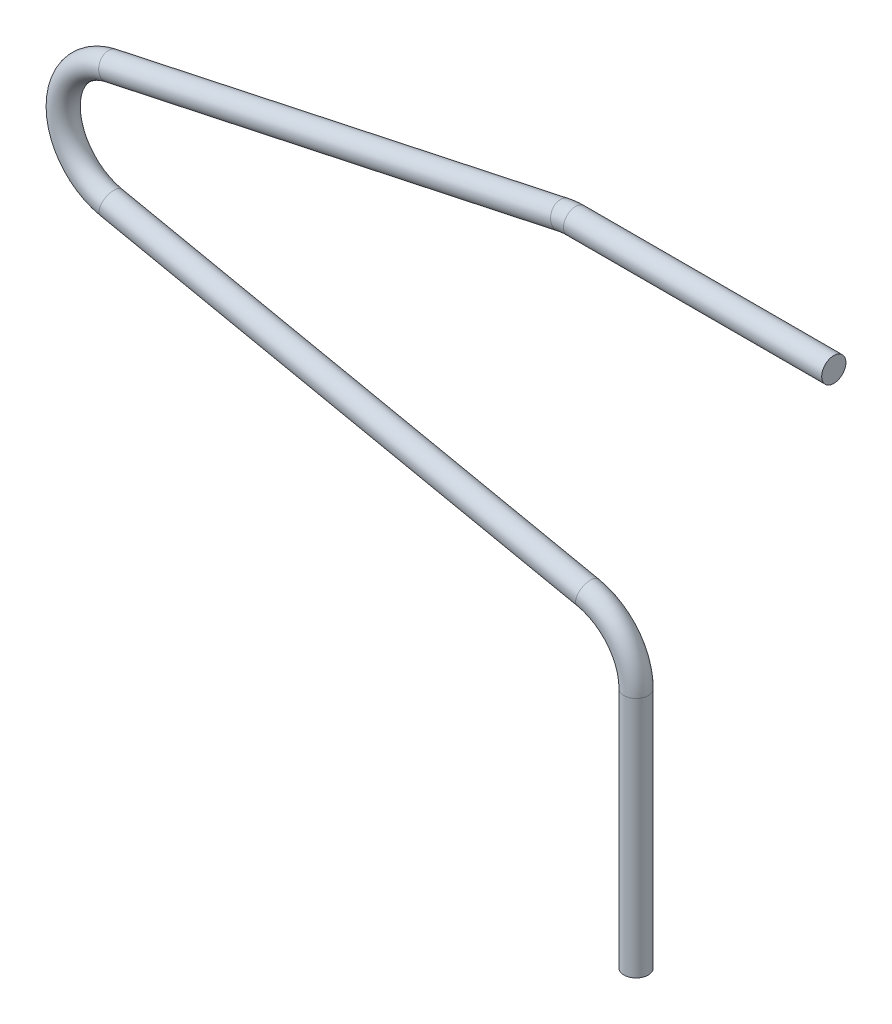
ISO-10303-21;
HEADER;
FILE_DESCRIPTION(('STEP AP214'),'2;1');
FILE_NAME('part.step','',(''),(''),'','','');
FILE_SCHEMA(('AUTOMOTIVE_DESIGN { 1 0 10303 214 1 1 1 1 }'));
ENDSEC;
DATA;
#1=APPLICATION_CONTEXT('core data for automotive mechanical design processes');
#2=APPLICATION_PROTOCOL_DEFINITION('international standard','automotive_design',2000,#1);
#3=PRODUCT_CONTEXT('',#1,'mechanical');
#4=PRODUCT('Part','Part','',(#3));
#5=PRODUCT_RELATED_PRODUCT_CATEGORY('part','',(#4));
#6=PRODUCT_DEFINITION_FORMATION('','',#4);
#7=PRODUCT_DEFINITION_CONTEXT('part definition',#1,'design');
#8=PRODUCT_DEFINITION('design','',#6,#7);
#9=PRODUCT_DEFINITION_SHAPE('','',#8);
#10=(LENGTH_UNIT() NAMED_UNIT(*) SI_UNIT(.MILLI.,.METRE.));
#11=(NAMED_UNIT(*) PLANE_ANGLE_UNIT() SI_UNIT($,.RADIAN.));
#12=(NAMED_UNIT(*) SI_UNIT($,.STERADIAN.) SOLID_ANGLE_UNIT());
#13=UNCERTAINTY_MEASURE_WITH_UNIT(LENGTH_MEASURE(1.E-05),#10,'distance_accuracy_value','');
#14=(GEOMETRIC_REPRESENTATION_CONTEXT(3) GLOBAL_UNCERTAINTY_ASSIGNED_CONTEXT((#13)) GLOBAL_UNIT_ASSIGNED_CONTEXT((#10,
#11,#12)) REPRESENTATION_CONTEXT('',''));
#15=CARTESIAN_POINT('',(0.,0.,0.));
#16=DIRECTION('',(0.,0.,1.));
#17=DIRECTION('',(1.,0.,0.));
#18=AXIS2_PLACEMENT_3D('',#15,#16,#17);
#19=CARTESIAN_POINT('',(-3.75,38.25,0.));
#20=DIRECTION('',(1.,0.,0.));
#21=DIRECTION('',(0.,1.,0.));
#22=AXIS2_PLACEMENT_3D('',#19,#20,#21);
#23=CYLINDRICAL_SURFACE('',#22,0.75);
#24=CARTESIAN_POINT('',(-3.75,38.25,0.));
#25=DIRECTION('',(1.,0.,0.));
#26=DIRECTION('',(0.,0.,1.));
#27=AXIS2_PLACEMENT_3D('',#24,#25,#26);
#28=CIRCLE('',#27,0.75);
#29=CARTESIAN_POINT('',(-3.75,39.,0.));
#30=VERTEX_POINT('',#29);
#31=EDGE_CURVE('E38',#30,#30,#28,.T.);
#32=ORIENTED_EDGE('',*,*,#31,.T.);
#33=EDGE_LOOP('',(#32));
#34=FACE_BOUND('',#33,.T.);
#35=CARTESIAN_POINT('',(12.25,38.25,0.));
#36=DIRECTION('',(1.,0.,0.));
#37=DIRECTION('',(0.,0.,1.));
#38=AXIS2_PLACEMENT_3D('',#35,#36,#37);
#39=CIRCLE('',#38,0.75);
#40=CARTESIAN_POINT('',(12.25,38.25,0.75));
#41=VERTEX_POINT('',#40);
#42=EDGE_CURVE('E10',#41,#41,#39,.T.);
#43=ORIENTED_EDGE('',*,*,#42,.F.);
#44=EDGE_LOOP('',(#43));
#45=FACE_BOUND('',#44,.T.);
#46=ADVANCED_FACE('F32',(#34,#45),#23,.T.);
#47=CARTESIAN_POINT('',(-3.75,34.5,0.));
#48=DIRECTION('',(0.,0.,-1.));
#49=DIRECTION('',(-1.,0.,0.));
#50=AXIS2_PLACEMENT_3D('',#47,#48,#49);
#51=TOROIDAL_SURFACE('',#50,3.75000000000001,0.75);
#52=CARTESIAN_POINT('',(-4.53573408274078,38.1667590527903,0.));
#53=DIRECTION('',(0.97780241407741,0.209529088730872,0.));
#54=DIRECTION('',(0.,0.,1.));
#55=AXIS2_PLACEMENT_3D('',#52,#53,#54);
#56=CIRCLE('',#55,0.75);
#57=CARTESIAN_POINT('',(-4.69288089928893,38.9001108633484,0.));
#58=VERTEX_POINT('',#57);
#59=EDGE_CURVE('E42',#58,#58,#56,.T.);
#60=CARTESIAN_POINT('',(-3.75,34.5,0.));
#61=DIRECTION('',(0.,0.,-1.));
#62=DIRECTION('',(-1.,0.,0.));
#63=AXIS2_PLACEMENT_3D('',#60,#61,#62);
#64=CIRCLE('',#63,4.50000000000001);
#65=EDGE_CURVE('',#58,#30,#64,.T.);
#66=ORIENTED_EDGE('',*,*,#59,.T.);
#67=ORIENTED_EDGE('',*,*,#31,.F.);
#68=ORIENTED_EDGE('',*,*,#65,.T.);
#69=ORIENTED_EDGE('',*,*,#65,.F.);
#70=EDGE_LOOP('',(#66,#68,#67,#69));
#71=FACE_BOUND('',#70,.T.);
#72=ADVANCED_FACE('F82',(#71),#51,.T.);
#73=CARTESIAN_POINT('',(-32.5357340827408,32.1667590527903,0.));
#74=DIRECTION('',(0.977802414077409,0.209529088730874,0.));
#75=DIRECTION('',(-0.209529088730874,0.97780241407741,0.));
#76=AXIS2_PLACEMENT_3D('',#73,#74,#75);
#77=CYLINDRICAL_SURFACE('',#76,0.75);
#78=CARTESIAN_POINT('',(-32.5357340827408,32.1667590527903,0.));
#79=DIRECTION('',(0.97780241407741,0.209529088730872,0.));
#80=DIRECTION('',(0.,0.,1.));
#81=AXIS2_PLACEMENT_3D('',#78,#79,#80);
#82=CIRCLE('',#81,0.75);
#83=CARTESIAN_POINT('',(-32.6928808992889,32.9001108633483,0.));
#84=VERTEX_POINT('',#83);
#85=EDGE_CURVE('E46',#84,#84,#82,.T.);
#86=ORIENTED_EDGE('',*,*,#85,.T.);
#87=EDGE_LOOP('',(#86));
#88=FACE_BOUND('',#87,.T.);
#89=ORIENTED_EDGE('',*,*,#59,.F.);
#90=EDGE_LOOP('',(#89));
#91=FACE_BOUND('',#90,.T.);
#92=ADVANCED_FACE('F86',(#88,#91),#77,.T.);
#93=CARTESIAN_POINT('',(-31.75,28.5,0.));
#94=DIRECTION('',(0.,0.,-1.));
#95=DIRECTION('',(-1.,0.,0.));
#96=AXIS2_PLACEMENT_3D('',#93,#94,#95);
#97=TOROIDAL_SURFACE('',#96,3.75,0.75);
#98=CARTESIAN_POINT('',(-32.5154998104125,24.8289633561815,0.));
#99=DIRECTION('',(-0.978943105018275,0.204133282776668,0.));
#100=DIRECTION('',(0.,0.,1.));
#101=AXIS2_PLACEMENT_3D('',#98,#99,#100);
#102=CIRCLE('',#101,0.75);
#103=CARTESIAN_POINT('',(-32.668599772495,24.0947560274178,0.));
#104=VERTEX_POINT('',#103);
#105=EDGE_CURVE('E51',#104,#104,#102,.T.);
#106=CARTESIAN_POINT('',(-31.75,28.5,0.));
#107=DIRECTION('',(0.,0.,-1.));
#108=DIRECTION('',(-1.,0.,0.));
#109=AXIS2_PLACEMENT_3D('',#106,#107,#108);
#110=CIRCLE('',#109,4.5);
#111=EDGE_CURVE('',#104,#84,#110,.T.);
#112=ORIENTED_EDGE('',*,*,#105,.T.);
#113=ORIENTED_EDGE('',*,*,#85,.F.);
#114=ORIENTED_EDGE('',*,*,#111,.T.);
#115=ORIENTED_EDGE('',*,*,#111,.F.);
#116=EDGE_LOOP('',(#112,#114,#113,#115));
#117=FACE_BOUND('',#116,.T.);
#118=ADVANCED_FACE('F92',(#117),#97,.T.);
#119=CARTESIAN_POINT('',(-2.98450018958749,18.6710366438185,0.));
#120=DIRECTION('',(-0.978943105018275,0.204133282776668,0.));
#121=DIRECTION('',(-0.204133282776668,-0.978943105018275,0.));
#122=AXIS2_PLACEMENT_3D('',#119,#120,#121);
#123=CYLINDRICAL_SURFACE('',#122,0.75);
#124=CARTESIAN_POINT('',(-2.98450018958749,18.6710366438185,0.));
#125=DIRECTION('',(-0.978943105018275,0.204133282776668,0.));
#126=DIRECTION('',(0.,0.,1.));
#127=AXIS2_PLACEMENT_3D('',#124,#125,#126);
#128=CIRCLE('',#127,0.75);
#129=CARTESIAN_POINT('',(-2.83140022750499,19.4052439725822,0.));
#130=VERTEX_POINT('',#129);
#131=EDGE_CURVE('E54',#130,#130,#128,.T.);
#132=ORIENTED_EDGE('',*,*,#131,.T.);
#133=EDGE_LOOP('',(#132));
#134=FACE_BOUND('',#133,.T.);
#135=ORIENTED_EDGE('',*,*,#105,.F.);
#136=EDGE_LOOP('',(#135));
#137=FACE_BOUND('',#136,.T.);
#138=ADVANCED_FACE('F99',(#134,#137),#123,.T.);
#139=CARTESIAN_POINT('',(-3.75,15.,0.));
#140=DIRECTION('',(0.,0.,1.));
#141=DIRECTION('',(1.,0.,0.));
#142=AXIS2_PLACEMENT_3D('',#139,#140,#141);
#143=TOROIDAL_SURFACE('',#142,3.75,0.75);
#144=CARTESIAN_POINT('',(0.,15.,0.));
#145=DIRECTION('',(0.,1.,0.));
#146=DIRECTION('',(0.,0.,1.));
#147=AXIS2_PLACEMENT_3D('',#144,#145,#146);
#148=CIRCLE('',#147,0.75);
#149=CARTESIAN_POINT('',(0.75,15.,0.));
#150=VERTEX_POINT('',#149);
#151=EDGE_CURVE('E57',#150,#150,#148,.T.);
#152=CARTESIAN_POINT('',(-3.75,15.,0.));
#153=DIRECTION('',(0.,0.,1.));
#154=DIRECTION('',(1.,0.,0.));
#155=AXIS2_PLACEMENT_3D('',#152,#153,#154);
#156=CIRCLE('',#155,4.5);
#157=EDGE_CURVE('',#150,#130,#156,.T.);
#158=ORIENTED_EDGE('',*,*,#151,.T.);
#159=ORIENTED_EDGE('',*,*,#131,.F.);
#160=ORIENTED_EDGE('',*,*,#157,.T.);
#161=ORIENTED_EDGE('',*,*,#157,.F.);
#162=EDGE_LOOP('',(#158,#160,#159,#161));
#163=FACE_BOUND('',#162,.T.);
#164=ADVANCED_FACE('F64',(#163),#143,.T.);
#165=CARTESIAN_POINT('',(0.,15.,0.));
#166=DIRECTION('',(0.,-1.,0.));
#167=DIRECTION('',(0.,0.,-1.));
#168=AXIS2_PLACEMENT_3D('',#165,#166,#167);
#169=CYLINDRICAL_SURFACE('',#168,0.75);
#170=ORIENTED_EDGE('',*,*,#151,.F.);
#171=EDGE_LOOP('',(#170));
#172=FACE_BOUND('',#171,.T.);
#173=CARTESIAN_POINT('',(0.,0.,0.));
#174=DIRECTION('',(0.,1.,0.));
#175=DIRECTION('',(0.,0.,1.));
#176=AXIS2_PLACEMENT_3D('',#173,#174,#175);
#177=CIRCLE('',#176,0.75);
#178=CARTESIAN_POINT('',(0.,0.,0.75));
#179=VERTEX_POINT('',#178);
#180=EDGE_CURVE('E58',#179,#179,#177,.T.);
#181=ORIENTED_EDGE('',*,*,#180,.T.);
#182=EDGE_LOOP('',(#181));
#183=FACE_BOUND('',#182,.T.);
#184=ADVANCED_FACE('F67',(#172,#183),#169,.T.);
#185=CARTESIAN_POINT('',(12.25,38.25,0.));
#186=DIRECTION('',(1.,0.,0.));
#187=DIRECTION('',(0.,0.,1.));
#188=AXIS2_PLACEMENT_3D('',#185,#186,#187);
#189=PLANE('',#188);
#190=ORIENTED_EDGE('',*,*,#42,.T.);
#191=EDGE_LOOP('',(#190));
#192=FACE_BOUND('',#191,.T.);
#193=ADVANCED_FACE('F70',(#192),#189,.T.);
#194=CARTESIAN_POINT('',(0.,0.,0.));
#195=DIRECTION('',(0.,1.,0.));
#196=DIRECTION('',(0.,0.,1.));
#197=AXIS2_PLACEMENT_3D('',#194,#195,#196);
#198=PLANE('',#197);
#199=ORIENTED_EDGE('',*,*,#180,.F.);
#200=EDGE_LOOP('',(#199));
#201=FACE_BOUND('',#200,.T.);
#202=ADVANCED_FACE('F74',(#201),#198,.F.);
#203=CLOSED_SHELL('',(#46,#72,#92,#118,#138,#164,#184,#193,#202));
#204=MANIFOLD_SOLID_BREP('B2',#203);
#205=ADVANCED_BREP_SHAPE_REPRESENTATION('',(#18,#204),#14);
#206=SHAPE_DEFINITION_REPRESENTATION(#9,#205);
ENDSEC;
END-ISO-10303-21;
